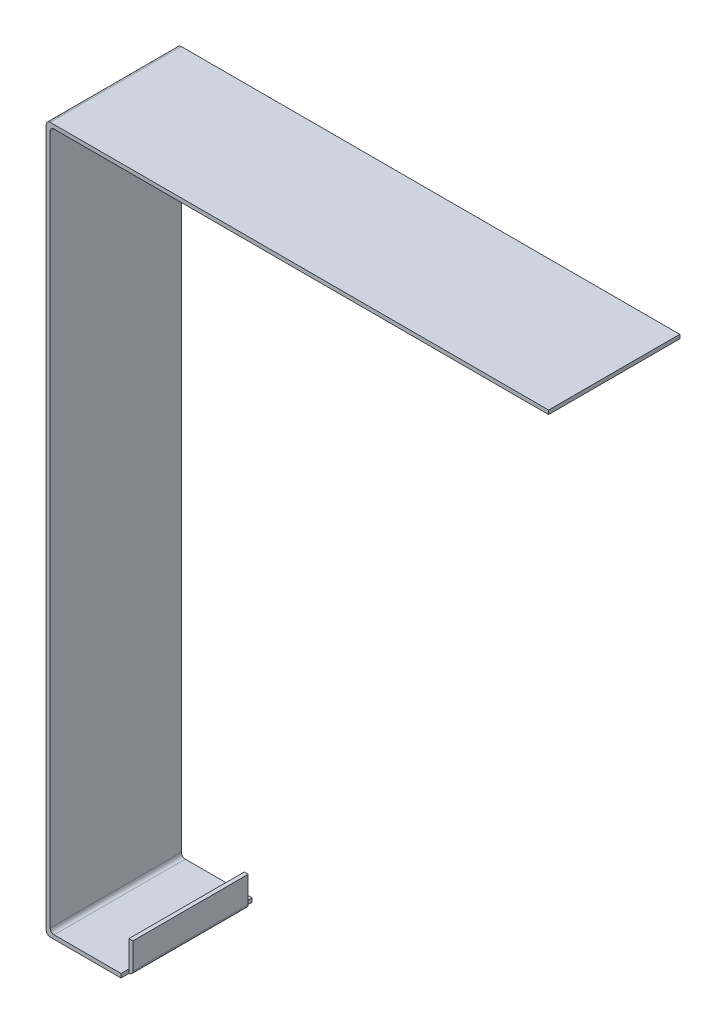
ISO-10303-21;
HEADER;
FILE_DESCRIPTION(('STEP AP214'),'2;1');
FILE_NAME('part.step','',(''),(''),'','','');
FILE_SCHEMA(('AUTOMOTIVE_DESIGN { 1 0 10303 214 1 1 1 1 }'));
ENDSEC;
DATA;
#1=APPLICATION_CONTEXT('core data for automotive mechanical design processes');
#2=APPLICATION_PROTOCOL_DEFINITION('international standard','automotive_design',2000,#1);
#3=PRODUCT_CONTEXT('',#1,'mechanical');
#4=PRODUCT('Part','Part','',(#3));
#5=PRODUCT_RELATED_PRODUCT_CATEGORY('part','',(#4));
#6=PRODUCT_DEFINITION_FORMATION('','',#4);
#7=PRODUCT_DEFINITION_CONTEXT('part definition',#1,'design');
#8=PRODUCT_DEFINITION('design','',#6,#7);
#9=PRODUCT_DEFINITION_SHAPE('','',#8);
#10=(LENGTH_UNIT() NAMED_UNIT(*) SI_UNIT(.MILLI.,.METRE.));
#11=(NAMED_UNIT(*) PLANE_ANGLE_UNIT() SI_UNIT($,.RADIAN.));
#12=(NAMED_UNIT(*) SI_UNIT($,.STERADIAN.) SOLID_ANGLE_UNIT());
#13=UNCERTAINTY_MEASURE_WITH_UNIT(LENGTH_MEASURE(1.E-05),#10,'distance_accuracy_value','');
#14=(GEOMETRIC_REPRESENTATION_CONTEXT(3) GLOBAL_UNCERTAINTY_ASSIGNED_CONTEXT((#13)) GLOBAL_UNIT_ASSIGNED_CONTEXT((#10,
#11,#12)) REPRESENTATION_CONTEXT('',''));
#15=CARTESIAN_POINT('',(0.,0.,0.));
#16=DIRECTION('',(0.,0.,1.));
#17=DIRECTION('',(1.,0.,0.));
#18=AXIS2_PLACEMENT_3D('',#15,#16,#17);
#19=CARTESIAN_POINT('',(-15.082688736803,-236.138930447239,50.));
#20=DIRECTION('',(0.,0.,-1.));
#21=DIRECTION('',(-1.,0.,0.));
#22=AXIS2_PLACEMENT_3D('',#19,#20,#21);
#23=CYLINDRICAL_SURFACE('',#22,1.5);
#24=DIRECTION('',(0.,0.,-1.));
#25=VECTOR('',#24,1.);
#26=CARTESIAN_POINT('',(-13.582688736803,-236.138930447239,50.));
#27=LINE('',#26,#25);
#28=CARTESIAN_POINT('',(-13.582688736803,-236.138930447239,47.));
#29=VERTEX_POINT('',#28);
#30=CARTESIAN_POINT('',(-13.582688736803,-236.138930447239,3.));
#31=VERTEX_POINT('',#30);
#32=EDGE_CURVE('E160',#29,#31,#27,.T.);
#33=ORIENTED_EDGE('',*,*,#32,.F.);
#34=CARTESIAN_POINT('',(-15.082688736803,-236.138930447239,47.));
#35=DIRECTION('',(0.,0.,-1.));
#36=DIRECTION('',(-1.,0.,0.));
#37=AXIS2_PLACEMENT_3D('',#34,#35,#36);
#38=CIRCLE('',#37,1.5);
#39=CARTESIAN_POINT('',(-15.082688736803,-237.638930447239,47.));
#40=VERTEX_POINT('',#39);
#41=EDGE_CURVE('E42',#40,#29,#38,.F.);
#42=ORIENTED_EDGE('',*,*,#41,.F.);
#43=DIRECTION('',(0.,0.,-1.));
#44=VECTOR('',#43,1.);
#45=CARTESIAN_POINT('',(-15.082688736803,-237.638930447239,50.));
#46=LINE('',#45,#44);
#47=CARTESIAN_POINT('',(-15.082688736803,-237.638930447239,3.));
#48=VERTEX_POINT('',#47);
#49=EDGE_CURVE('E170',#48,#40,#46,.F.);
#50=ORIENTED_EDGE('',*,*,#49,.F.);
#51=CARTESIAN_POINT('',(-15.082688736803,-236.138930447239,3.));
#52=DIRECTION('',(0.,0.,1.));
#53=DIRECTION('',(1.,0.,0.));
#54=AXIS2_PLACEMENT_3D('',#51,#52,#53);
#55=CIRCLE('',#54,1.5);
#56=EDGE_CURVE('E11',#31,#48,#55,.F.);
#57=ORIENTED_EDGE('',*,*,#56,.F.);
#58=EDGE_LOOP('',(#33,#42,#50,#57));
#59=FACE_BOUND('',#58,.T.);
#60=ADVANCED_FACE('F35',(#59),#23,.T.);
#61=CARTESIAN_POINT('',(-42.082688736803,29.8610695527614,50.));
#62=DIRECTION('',(0.,0.,-1.));
#63=DIRECTION('',(-1.,0.,0.));
#64=AXIS2_PLACEMENT_3D('',#61,#62,#63);
#65=PLANE('',#64);
#66=DIRECTION('',(0.,-1.,0.));
#67=VECTOR('',#66,1.);
#68=CARTESIAN_POINT('',(-15.082688736803,29.8610695527614,50.));
#69=LINE('',#68,#67);
#70=CARTESIAN_POINT('',(-15.082688736803,-236.138930447239,50.));
#71=VERTEX_POINT('',#70);
#72=CARTESIAN_POINT('',(-15.082688736803,-237.638930447239,50.));
#73=VERTEX_POINT('',#72);
#74=EDGE_CURVE('E150',#71,#73,#69,.T.);
#75=ORIENTED_EDGE('',*,*,#74,.F.);
#76=DIRECTION('',(-1.,0.,0.));
#77=VECTOR('',#76,1.);
#78=CARTESIAN_POINT('',(-15.082688736803,-236.138930447239,50.));
#79=LINE('',#78,#77);
#80=CARTESIAN_POINT('',(-40.582688736803,-236.138930447239,50.));
#81=VERTEX_POINT('',#80);
#82=EDGE_CURVE('E178',#71,#81,#79,.T.);
#83=ORIENTED_EDGE('',*,*,#82,.T.);
#84=CARTESIAN_POINT('',(-40.582688736803,-234.638930447239,50.));
#85=DIRECTION('',(0.,0.,-1.));
#86=DIRECTION('',(1.,0.,0.));
#87=AXIS2_PLACEMENT_3D('',#84,#85,#86);
#88=CIRCLE('',#87,1.5);
#89=CARTESIAN_POINT('',(-42.082688736803,-234.638930447239,50.));
#90=VERTEX_POINT('',#89);
#91=EDGE_CURVE('E180',#81,#90,#88,.T.);
#92=ORIENTED_EDGE('',*,*,#91,.T.);
#93=DIRECTION('',(0.,1.,0.));
#94=VECTOR('',#93,1.);
#95=CARTESIAN_POINT('',(-42.082688736803,-226.138930447239,50.));
#96=LINE('',#95,#94);
#97=CARTESIAN_POINT('',(-42.082688736803,28.3610695527614,50.));
#98=VERTEX_POINT('',#97);
#99=EDGE_CURVE('E187',#90,#98,#96,.T.);
#100=ORIENTED_EDGE('',*,*,#99,.T.);
#101=CARTESIAN_POINT('',(-40.582688736803,28.3610695527614,50.));
#102=DIRECTION('',(0.,0.,-1.));
#103=DIRECTION('',(-1.,0.,0.));
#104=AXIS2_PLACEMENT_3D('',#101,#102,#103);
#105=CIRCLE('',#104,1.5);
#106=CARTESIAN_POINT('',(-40.582688736803,29.8610695527614,50.));
#107=VERTEX_POINT('',#106);
#108=EDGE_CURVE('E189',#98,#107,#105,.T.);
#109=ORIENTED_EDGE('',*,*,#108,.T.);
#110=DIRECTION('',(1.,0.,0.));
#111=VECTOR('',#110,1.);
#112=CARTESIAN_POINT('',(-40.582688736803,29.8610695527614,50.));
#113=LINE('',#112,#111);
#114=CARTESIAN_POINT('',(147.917311263197,29.8610695527614,50.));
#115=VERTEX_POINT('',#114);
#116=EDGE_CURVE('E191',#107,#115,#113,.T.);
#117=ORIENTED_EDGE('',*,*,#116,.T.);
#118=DIRECTION('',(0.,1.,0.));
#119=VECTOR('',#118,1.);
#120=CARTESIAN_POINT('',(147.917311263197,29.8610695527614,50.));
#121=LINE('',#120,#119);
#122=CARTESIAN_POINT('',(147.917311263197,31.3610695527614,50.));
#123=VERTEX_POINT('',#122);
#124=EDGE_CURVE('E221',#115,#123,#121,.T.);
#125=ORIENTED_EDGE('',*,*,#124,.T.);
#126=DIRECTION('',(-1.,0.,0.));
#127=VECTOR('',#126,1.);
#128=CARTESIAN_POINT('',(-42.082688736803,31.3610695527614,50.));
#129=LINE('',#128,#127);
#130=CARTESIAN_POINT('',(-42.082688736803,31.3610695527614,50.));
#131=VERTEX_POINT('',#130);
#132=EDGE_CURVE('E285',#123,#131,#129,.T.);
#133=ORIENTED_EDGE('',*,*,#132,.T.);
#134=CARTESIAN_POINT('',(-42.082688736803,29.8610695527614,50.));
#135=DIRECTION('',(0.,0.,1.));
#136=DIRECTION('',(-1.,0.,0.));
#137=AXIS2_PLACEMENT_3D('',#134,#135,#136);
#138=CIRCLE('',#137,1.5);
#139=CARTESIAN_POINT('',(-43.582688736803,29.8610695527614,50.));
#140=VERTEX_POINT('',#139);
#141=EDGE_CURVE('E287',#131,#140,#138,.T.);
#142=ORIENTED_EDGE('',*,*,#141,.T.);
#143=DIRECTION('',(0.,-1.,0.));
#144=VECTOR('',#143,1.);
#145=CARTESIAN_POINT('',(-43.582688736803,-236.138930447239,50.));
#146=LINE('',#145,#144);
#147=CARTESIAN_POINT('',(-43.582688736803,-236.138930447239,50.));
#148=VERTEX_POINT('',#147);
#149=EDGE_CURVE('E182',#140,#148,#146,.T.);
#150=ORIENTED_EDGE('',*,*,#149,.T.);
#151=CARTESIAN_POINT('',(-42.082688736803,-236.138930447239,50.));
#152=DIRECTION('',(0.,0.,1.));
#153=DIRECTION('',(1.,0.,0.));
#154=AXIS2_PLACEMENT_3D('',#151,#152,#153);
#155=CIRCLE('',#154,1.5);
#156=CARTESIAN_POINT('',(-42.082688736803,-237.638930447239,50.));
#157=VERTEX_POINT('',#156);
#158=EDGE_CURVE('E176',#148,#157,#155,.T.);
#159=ORIENTED_EDGE('',*,*,#158,.T.);
#160=DIRECTION('',(1.,0.,0.));
#161=VECTOR('',#160,1.);
#162=CARTESIAN_POINT('',(-15.082688736803,-237.638930447239,50.));
#163=LINE('',#162,#161);
#164=EDGE_CURVE('E169',#157,#73,#163,.T.);
#165=ORIENTED_EDGE('',*,*,#164,.T.);
#166=EDGE_LOOP('',(#75,#83,#92,#100,#109,#117,#125,#133,#142,#150,#159,#165));
#167=FACE_BOUND('',#166,.T.);
#168=ADVANCED_FACE('F174',(#167),#65,.F.);
#169=CARTESIAN_POINT('',(147.917311263197,29.8610695527614,50.));
#170=DIRECTION('',(-1.,0.,0.));
#171=DIRECTION('',(0.,0.,1.));
#172=AXIS2_PLACEMENT_3D('',#169,#170,#171);
#173=PLANE('',#172);
#174=DIRECTION('',(0.,1.,0.));
#175=VECTOR('',#174,1.);
#176=CARTESIAN_POINT('',(147.917311263197,29.8610695527614,0.));
#177=LINE('',#176,#175);
#178=CARTESIAN_POINT('',(147.917311263197,29.8610695527614,0.));
#179=VERTEX_POINT('',#178);
#180=CARTESIAN_POINT('',(147.917311263197,31.3610695527614,0.));
#181=VERTEX_POINT('',#180);
#182=EDGE_CURVE('E194',#179,#181,#177,.T.);
#183=ORIENTED_EDGE('',*,*,#182,.T.);
#184=DIRECTION('',(0.,0.,-1.));
#185=VECTOR('',#184,1.);
#186=CARTESIAN_POINT('',(147.917311263197,31.3610695527614,50.));
#187=LINE('',#186,#185);
#188=EDGE_CURVE('E161',#123,#181,#187,.T.);
#189=ORIENTED_EDGE('',*,*,#188,.F.);
#190=ORIENTED_EDGE('',*,*,#124,.F.);
#191=DIRECTION('',(0.,0.,-1.));
#192=VECTOR('',#191,1.);
#193=CARTESIAN_POINT('',(147.917311263197,29.8610695527614,50.));
#194=LINE('',#193,#192);
#195=EDGE_CURVE('E193',#115,#179,#194,.T.);
#196=ORIENTED_EDGE('',*,*,#195,.T.);
#197=EDGE_LOOP('',(#183,#189,#190,#196));
#198=FACE_BOUND('',#197,.T.);
#199=ADVANCED_FACE('F331',(#198),#173,.F.);
#200=CARTESIAN_POINT('',(-42.082688736803,31.3610695527614,50.));
#201=DIRECTION('',(0.,-1.,0.));
#202=DIRECTION('',(1.,0.,0.));
#203=AXIS2_PLACEMENT_3D('',#200,#201,#202);
#204=PLANE('',#203);
#205=DIRECTION('',(-1.,0.,0.));
#206=VECTOR('',#205,1.);
#207=CARTESIAN_POINT('',(-42.082688736803,31.3610695527614,0.));
#208=LINE('',#207,#206);
#209=CARTESIAN_POINT('',(-42.082688736803,31.3610695527614,0.));
#210=VERTEX_POINT('',#209);
#211=EDGE_CURVE('E197',#181,#210,#208,.T.);
#212=ORIENTED_EDGE('',*,*,#211,.T.);
#213=DIRECTION('',(0.,0.,-1.));
#214=VECTOR('',#213,1.);
#215=CARTESIAN_POINT('',(-42.082688736803,31.3610695527614,50.));
#216=LINE('',#215,#214);
#217=EDGE_CURVE('E252',#131,#210,#216,.T.);
#218=ORIENTED_EDGE('',*,*,#217,.F.);
#219=ORIENTED_EDGE('',*,*,#132,.F.);
#220=ORIENTED_EDGE('',*,*,#188,.T.);
#221=EDGE_LOOP('',(#212,#218,#219,#220));
#222=FACE_BOUND('',#221,.T.);
#223=ADVANCED_FACE('F336',(#222),#204,.F.);
#224=CARTESIAN_POINT('',(-42.082688736803,29.8610695527614,50.));
#225=DIRECTION('',(0.,0.,-1.));
#226=DIRECTION('',(-1.,0.,0.));
#227=AXIS2_PLACEMENT_3D('',#224,#225,#226);
#228=CYLINDRICAL_SURFACE('',#227,1.5);
#229=CARTESIAN_POINT('',(-42.082688736803,29.8610695527614,0.));
#230=DIRECTION('',(0.,0.,1.));
#231=DIRECTION('',(-1.,0.,0.));
#232=AXIS2_PLACEMENT_3D('',#229,#230,#231);
#233=CIRCLE('',#232,1.5);
#234=CARTESIAN_POINT('',(-43.582688736803,29.8610695527614,0.));
#235=VERTEX_POINT('',#234);
#236=EDGE_CURVE('E200',#210,#235,#233,.T.);
#237=ORIENTED_EDGE('',*,*,#236,.T.);
#238=DIRECTION('',(0.,0.,-1.));
#239=VECTOR('',#238,1.);
#240=CARTESIAN_POINT('',(-43.582688736803,29.8610695527614,50.));
#241=LINE('',#240,#239);
#242=EDGE_CURVE('E249',#140,#235,#241,.T.);
#243=ORIENTED_EDGE('',*,*,#242,.F.);
#244=ORIENTED_EDGE('',*,*,#141,.F.);
#245=ORIENTED_EDGE('',*,*,#217,.T.);
#246=EDGE_LOOP('',(#237,#243,#244,#245));
#247=FACE_BOUND('',#246,.T.);
#248=ADVANCED_FACE('F375',(#247),#228,.T.);
#249=CARTESIAN_POINT('',(-43.582688736803,-236.138930447239,50.));
#250=DIRECTION('',(1.,0.,0.));
#251=DIRECTION('',(0.,0.,-1.));
#252=AXIS2_PLACEMENT_3D('',#249,#250,#251);
#253=PLANE('',#252);
#254=DIRECTION('',(0.,-1.,0.));
#255=VECTOR('',#254,1.);
#256=CARTESIAN_POINT('',(-43.582688736803,-236.138930447239,0.));
#257=LINE('',#256,#255);
#258=CARTESIAN_POINT('',(-43.582688736803,-236.138930447239,0.));
#259=VERTEX_POINT('',#258);
#260=EDGE_CURVE('E202',#235,#259,#257,.T.);
#261=ORIENTED_EDGE('',*,*,#260,.T.);
#262=DIRECTION('',(0.,0.,-1.));
#263=VECTOR('',#262,1.);
#264=CARTESIAN_POINT('',(-43.582688736803,-236.138930447239,50.));
#265=LINE('',#264,#263);
#266=EDGE_CURVE('E246',#148,#259,#265,.T.);
#267=ORIENTED_EDGE('',*,*,#266,.F.);
#268=ORIENTED_EDGE('',*,*,#149,.F.);
#269=ORIENTED_EDGE('',*,*,#242,.T.);
#270=EDGE_LOOP('',(#261,#267,#268,#269));
#271=FACE_BOUND('',#270,.T.);
#272=ADVANCED_FACE('F293',(#271),#253,.F.);
#273=CARTESIAN_POINT('',(-42.082688736803,-236.138930447239,50.));
#274=DIRECTION('',(0.,0.,-1.));
#275=DIRECTION('',(-1.,0.,0.));
#276=AXIS2_PLACEMENT_3D('',#273,#274,#275);
#277=CYLINDRICAL_SURFACE('',#276,1.5);
#278=CARTESIAN_POINT('',(-42.082688736803,-236.138930447239,0.));
#279=DIRECTION('',(0.,0.,1.));
#280=DIRECTION('',(1.,0.,0.));
#281=AXIS2_PLACEMENT_3D('',#278,#279,#280);
#282=CIRCLE('',#281,1.5);
#283=CARTESIAN_POINT('',(-42.082688736803,-237.638930447239,0.));
#284=VERTEX_POINT('',#283);
#285=EDGE_CURVE('E204',#259,#284,#282,.T.);
#286=ORIENTED_EDGE('',*,*,#285,.T.);
#287=DIRECTION('',(0.,0.,-1.));
#288=VECTOR('',#287,1.);
#289=CARTESIAN_POINT('',(-42.082688736803,-237.638930447239,50.));
#290=LINE('',#289,#288);
#291=EDGE_CURVE('E244',#157,#284,#290,.T.);
#292=ORIENTED_EDGE('',*,*,#291,.F.);
#293=ORIENTED_EDGE('',*,*,#158,.F.);
#294=ORIENTED_EDGE('',*,*,#266,.T.);
#295=EDGE_LOOP('',(#286,#292,#293,#294));
#296=FACE_BOUND('',#295,.T.);
#297=ADVANCED_FACE('F297',(#296),#277,.T.);
#298=CARTESIAN_POINT('',(-13.582688736803,-237.638930447239,50.));
#299=DIRECTION('',(0.,1.,0.));
#300=DIRECTION('',(0.,0.,1.));
#301=AXIS2_PLACEMENT_3D('',#298,#299,#300);
#302=PLANE('',#301);
#303=DIRECTION('',(0.,0.,-1.));
#304=VECTOR('',#303,1.);
#305=CARTESIAN_POINT('',(-15.082688736803,-237.638930447239,0.));
#306=LINE('',#305,#304);
#307=CARTESIAN_POINT('',(-15.082688736803,-237.638930447239,0.));
#308=VERTEX_POINT('',#307);
#309=EDGE_CURVE('E298',#48,#308,#306,.T.);
#310=ORIENTED_EDGE('',*,*,#309,.F.);
#311=ORIENTED_EDGE('',*,*,#49,.T.);
#312=DIRECTION('',(0.,0.,-1.));
#313=VECTOR('',#312,1.);
#314=CARTESIAN_POINT('',(-15.082688736803,-237.638930447239,50.));
#315=LINE('',#314,#313);
#316=EDGE_CURVE('E154',#73,#40,#315,.T.);
#317=ORIENTED_EDGE('',*,*,#316,.F.);
#318=ORIENTED_EDGE('',*,*,#164,.F.);
#319=ORIENTED_EDGE('',*,*,#291,.T.);
#320=DIRECTION('',(1.,0.,0.));
#321=VECTOR('',#320,1.);
#322=CARTESIAN_POINT('',(-13.582688736803,-237.638930447239,0.));
#323=LINE('',#322,#321);
#324=EDGE_CURVE('E207',#284,#308,#323,.T.);
#325=ORIENTED_EDGE('',*,*,#324,.T.);
#326=EDGE_LOOP('',(#310,#311,#317,#318,#319,#325));
#327=FACE_BOUND('',#326,.T.);
#328=ADVANCED_FACE('F167',(#327),#302,.F.);
#329=CARTESIAN_POINT('',(-13.582688736803,-226.138930447239,50.));
#330=DIRECTION('',(-1.,0.,0.));
#331=DIRECTION('',(0.,0.,1.));
#332=AXIS2_PLACEMENT_3D('',#329,#330,#331);
#333=PLANE('',#332);
#334=DIRECTION('',(0.,1.,0.));
#335=VECTOR('',#334,1.);
#336=CARTESIAN_POINT('',(-13.582688736803,-237.638930447239,47.));
#337=LINE('',#336,#335);
#338=CARTESIAN_POINT('',(-13.582688736803,-226.138930447239,47.));
#339=VERTEX_POINT('',#338);
#340=EDGE_CURVE('E172',#29,#339,#337,.T.);
#341=ORIENTED_EDGE('',*,*,#340,.F.);
#342=ORIENTED_EDGE('',*,*,#32,.T.);
#343=DIRECTION('',(0.,-1.,0.));
#344=VECTOR('',#343,1.);
#345=CARTESIAN_POINT('',(-13.582688736803,-237.638930447239,3.));
#346=LINE('',#345,#344);
#347=CARTESIAN_POINT('',(-13.582688736803,-226.138930447239,3.));
#348=VERTEX_POINT('',#347);
#349=EDGE_CURVE('E264',#348,#31,#346,.T.);
#350=ORIENTED_EDGE('',*,*,#349,.F.);
#351=DIRECTION('',(0.,0.,-1.));
#352=VECTOR('',#351,1.);
#353=CARTESIAN_POINT('',(-13.582688736803,-226.138930447239,50.));
#354=LINE('',#353,#352);
#355=EDGE_CURVE('E241',#339,#348,#354,.T.);
#356=ORIENTED_EDGE('',*,*,#355,.F.);
#357=EDGE_LOOP('',(#341,#342,#350,#356));
#358=FACE_BOUND('',#357,.T.);
#359=ADVANCED_FACE('F262',(#358),#333,.F.);
#360=CARTESIAN_POINT('',(-15.082688736803,-226.138930447239,50.));
#361=DIRECTION('',(0.,-1.,0.));
#362=DIRECTION('',(0.,0.,-1.));
#363=AXIS2_PLACEMENT_3D('',#360,#361,#362);
#364=PLANE('',#363);
#365=DIRECTION('',(0.,0.,-1.));
#366=VECTOR('',#365,1.);
#367=CARTESIAN_POINT('',(-15.082688736803,-226.138930447239,50.));
#368=LINE('',#367,#366);
#369=CARTESIAN_POINT('',(-15.082688736803,-226.138930447239,47.));
#370=VERTEX_POINT('',#369);
#371=CARTESIAN_POINT('',(-15.082688736803,-226.138930447239,3.));
#372=VERTEX_POINT('',#371);
#373=EDGE_CURVE('E238',#370,#372,#368,.T.);
#374=ORIENTED_EDGE('',*,*,#373,.F.);
#375=DIRECTION('',(1.,0.,0.));
#376=VECTOR('',#375,1.);
#377=CARTESIAN_POINT('',(-15.082688736803,-226.138930447239,47.));
#378=LINE('',#377,#376);
#379=EDGE_CURVE('E282',#370,#339,#378,.T.);
#380=ORIENTED_EDGE('',*,*,#379,.T.);
#381=ORIENTED_EDGE('',*,*,#355,.T.);
#382=DIRECTION('',(1.,0.,0.));
#383=VECTOR('',#382,1.);
#384=CARTESIAN_POINT('',(-15.082688736803,-226.138930447239,3.));
#385=LINE('',#384,#383);
#386=EDGE_CURVE('E269',#372,#348,#385,.T.);
#387=ORIENTED_EDGE('',*,*,#386,.F.);
#388=EDGE_LOOP('',(#374,#380,#381,#387));
#389=FACE_BOUND('',#388,.T.);
#390=ADVANCED_FACE('F318',(#389),#364,.F.);
#391=CARTESIAN_POINT('',(-15.082688736803,-234.638930447239,50.));
#392=DIRECTION('',(1.,0.,0.));
#393=DIRECTION('',(0.,0.,-1.));
#394=AXIS2_PLACEMENT_3D('',#391,#392,#393);
#395=PLANE('',#394);
#396=DIRECTION('',(0.,0.,-1.));
#397=VECTOR('',#396,1.);
#398=CARTESIAN_POINT('',(-15.082688736803,-236.138930447239,50.));
#399=LINE('',#398,#397);
#400=CARTESIAN_POINT('',(-15.082688736803,-236.138930447239,47.));
#401=VERTEX_POINT('',#400);
#402=CARTESIAN_POINT('',(-15.082688736803,-236.138930447239,3.));
#403=VERTEX_POINT('',#402);
#404=EDGE_CURVE('E236',#401,#403,#399,.T.);
#405=ORIENTED_EDGE('',*,*,#404,.F.);
#406=DIRECTION('',(0.,1.,0.));
#407=VECTOR('',#406,1.);
#408=CARTESIAN_POINT('',(-15.082688736803,-237.638930447239,47.));
#409=LINE('',#408,#407);
#410=EDGE_CURVE('E171',#401,#370,#409,.T.);
#411=ORIENTED_EDGE('',*,*,#410,.T.);
#412=ORIENTED_EDGE('',*,*,#373,.T.);
#413=DIRECTION('',(0.,-1.,0.));
#414=VECTOR('',#413,1.);
#415=CARTESIAN_POINT('',(-15.082688736803,-237.638930447239,3.));
#416=LINE('',#415,#414);
#417=EDGE_CURVE('E273',#372,#403,#416,.T.);
#418=ORIENTED_EDGE('',*,*,#417,.T.);
#419=EDGE_LOOP('',(#405,#411,#412,#418));
#420=FACE_BOUND('',#419,.T.);
#421=ADVANCED_FACE('F315',(#420),#395,.F.);
#422=CARTESIAN_POINT('',(-40.582688736803,-236.138930447239,50.));
#423=DIRECTION('',(0.,-1.,0.));
#424=DIRECTION('',(0.,0.,-1.));
#425=AXIS2_PLACEMENT_3D('',#422,#423,#424);
#426=PLANE('',#425);
#427=DIRECTION('',(-1.,0.,0.));
#428=VECTOR('',#427,1.);
#429=CARTESIAN_POINT('',(-40.582688736803,-236.138930447239,0.));
#430=LINE('',#429,#428);
#431=CARTESIAN_POINT('',(-15.082688736803,-236.138930447239,0.));
#432=VERTEX_POINT('',#431);
#433=CARTESIAN_POINT('',(-40.582688736803,-236.138930447239,0.));
#434=VERTEX_POINT('',#433);
#435=EDGE_CURVE('E210',#432,#434,#430,.T.);
#436=ORIENTED_EDGE('',*,*,#435,.T.);
#437=DIRECTION('',(0.,0.,-1.));
#438=VECTOR('',#437,1.);
#439=CARTESIAN_POINT('',(-40.582688736803,-236.138930447239,50.));
#440=LINE('',#439,#438);
#441=EDGE_CURVE('E233',#81,#434,#440,.T.);
#442=ORIENTED_EDGE('',*,*,#441,.F.);
#443=ORIENTED_EDGE('',*,*,#82,.F.);
#444=EDGE_CURVE('E156',#71,#401,#399,.T.);
#445=ORIENTED_EDGE('',*,*,#444,.T.);
#446=ORIENTED_EDGE('',*,*,#404,.T.);
#447=DIRECTION('',(0.,0.,-1.));
#448=VECTOR('',#447,1.);
#449=CARTESIAN_POINT('',(-15.082688736803,-236.138930447239,50.));
#450=LINE('',#449,#448);
#451=EDGE_CURVE('E198',#403,#432,#450,.T.);
#452=ORIENTED_EDGE('',*,*,#451,.T.);
#453=EDGE_LOOP('',(#436,#442,#443,#445,#446,#452));
#454=FACE_BOUND('',#453,.T.);
#455=ADVANCED_FACE('F358',(#454),#426,.F.);
#456=CARTESIAN_POINT('',(-40.582688736803,-234.638930447239,50.));
#457=DIRECTION('',(0.,0.,-1.));
#458=DIRECTION('',(-1.,0.,0.));
#459=AXIS2_PLACEMENT_3D('',#456,#457,#458);
#460=CYLINDRICAL_SURFACE('',#459,1.5);
#461=CARTESIAN_POINT('',(-40.582688736803,-234.638930447239,0.));
#462=DIRECTION('',(0.,0.,-1.));
#463=DIRECTION('',(1.,0.,0.));
#464=AXIS2_PLACEMENT_3D('',#461,#462,#463);
#465=CIRCLE('',#464,1.5);
#466=CARTESIAN_POINT('',(-42.082688736803,-234.638930447239,0.));
#467=VERTEX_POINT('',#466);
#468=EDGE_CURVE('E212',#434,#467,#465,.T.);
#469=ORIENTED_EDGE('',*,*,#468,.T.);
#470=DIRECTION('',(0.,0.,-1.));
#471=VECTOR('',#470,1.);
#472=CARTESIAN_POINT('',(-42.082688736803,-234.638930447239,50.));
#473=LINE('',#472,#471);
#474=EDGE_CURVE('E230',#90,#467,#473,.T.);
#475=ORIENTED_EDGE('',*,*,#474,.F.);
#476=ORIENTED_EDGE('',*,*,#91,.F.);
#477=ORIENTED_EDGE('',*,*,#441,.T.);
#478=EDGE_LOOP('',(#469,#475,#476,#477));
#479=FACE_BOUND('',#478,.T.);
#480=ADVANCED_FACE('F354',(#479),#460,.F.);
#481=CARTESIAN_POINT('',(-42.082688736803,28.3610695527614,50.));
#482=DIRECTION('',(-1.,0.,0.));
#483=DIRECTION('',(0.,0.,1.));
#484=AXIS2_PLACEMENT_3D('',#481,#482,#483);
#485=PLANE('',#484);
#486=DIRECTION('',(0.,1.,0.));
#487=VECTOR('',#486,1.);
#488=CARTESIAN_POINT('',(-42.082688736803,28.3610695527614,0.));
#489=LINE('',#488,#487);
#490=CARTESIAN_POINT('',(-42.082688736803,28.3610695527614,0.));
#491=VERTEX_POINT('',#490);
#492=EDGE_CURVE('E215',#467,#491,#489,.T.);
#493=ORIENTED_EDGE('',*,*,#492,.T.);
#494=DIRECTION('',(0.,0.,-1.));
#495=VECTOR('',#494,1.);
#496=CARTESIAN_POINT('',(-42.082688736803,28.3610695527614,50.));
#497=LINE('',#496,#495);
#498=EDGE_CURVE('E227',#98,#491,#497,.T.);
#499=ORIENTED_EDGE('',*,*,#498,.F.);
#500=ORIENTED_EDGE('',*,*,#99,.F.);
#501=ORIENTED_EDGE('',*,*,#474,.T.);
#502=EDGE_LOOP('',(#493,#499,#500,#501));
#503=FACE_BOUND('',#502,.T.);
#504=ADVANCED_FACE('F350',(#503),#485,.F.);
#505=CARTESIAN_POINT('',(-40.582688736803,28.3610695527614,50.));
#506=DIRECTION('',(0.,0.,-1.));
#507=DIRECTION('',(-1.,0.,0.));
#508=AXIS2_PLACEMENT_3D('',#505,#506,#507);
#509=CYLINDRICAL_SURFACE('',#508,1.5);
#510=CARTESIAN_POINT('',(-40.582688736803,28.3610695527614,0.));
#511=DIRECTION('',(0.,0.,-1.));
#512=DIRECTION('',(-1.,0.,0.));
#513=AXIS2_PLACEMENT_3D('',#510,#511,#512);
#514=CIRCLE('',#513,1.5);
#515=CARTESIAN_POINT('',(-40.582688736803,29.8610695527614,0.));
#516=VERTEX_POINT('',#515);
#517=EDGE_CURVE('E217',#491,#516,#514,.T.);
#518=ORIENTED_EDGE('',*,*,#517,.T.);
#519=DIRECTION('',(0.,0.,-1.));
#520=VECTOR('',#519,1.);
#521=CARTESIAN_POINT('',(-40.582688736803,29.8610695527614,50.));
#522=LINE('',#521,#520);
#523=EDGE_CURVE('E224',#107,#516,#522,.T.);
#524=ORIENTED_EDGE('',*,*,#523,.F.);
#525=ORIENTED_EDGE('',*,*,#108,.F.);
#526=ORIENTED_EDGE('',*,*,#498,.T.);
#527=EDGE_LOOP('',(#518,#524,#525,#526));
#528=FACE_BOUND('',#527,.T.);
#529=ADVANCED_FACE('F346',(#528),#509,.F.);
#530=CARTESIAN_POINT('',(-40.582688736803,29.8610695527614,50.));
#531=DIRECTION('',(0.,1.,0.));
#532=DIRECTION('',(0.,0.,1.));
#533=AXIS2_PLACEMENT_3D('',#530,#531,#532);
#534=PLANE('',#533);
#535=DIRECTION('',(1.,0.,0.));
#536=VECTOR('',#535,1.);
#537=CARTESIAN_POINT('',(-40.582688736803,29.8610695527614,0.));
#538=LINE('',#537,#536);
#539=EDGE_CURVE('E219',#516,#179,#538,.T.);
#540=ORIENTED_EDGE('',*,*,#539,.T.);
#541=ORIENTED_EDGE('',*,*,#195,.F.);
#542=ORIENTED_EDGE('',*,*,#116,.F.);
#543=ORIENTED_EDGE('',*,*,#523,.T.);
#544=EDGE_LOOP('',(#540,#541,#542,#543));
#545=FACE_BOUND('',#544,.T.);
#546=ADVANCED_FACE('F343',(#545),#534,.F.);
#547=CARTESIAN_POINT('',(-42.082688736803,29.8610695527614,0.));
#548=DIRECTION('',(0.,0.,-1.));
#549=DIRECTION('',(-1.,0.,0.));
#550=AXIS2_PLACEMENT_3D('',#547,#548,#549);
#551=PLANE('',#550);
#552=DIRECTION('',(0.,1.,0.));
#553=VECTOR('',#552,1.);
#554=CARTESIAN_POINT('',(-15.082688736803,-226.138930447239,0.));
#555=LINE('',#554,#553);
#556=EDGE_CURVE('E277',#308,#432,#555,.T.);
#557=ORIENTED_EDGE('',*,*,#556,.F.);
#558=ORIENTED_EDGE('',*,*,#324,.F.);
#559=ORIENTED_EDGE('',*,*,#285,.F.);
#560=ORIENTED_EDGE('',*,*,#260,.F.);
#561=ORIENTED_EDGE('',*,*,#236,.F.);
#562=ORIENTED_EDGE('',*,*,#211,.F.);
#563=ORIENTED_EDGE('',*,*,#182,.F.);
#564=ORIENTED_EDGE('',*,*,#539,.F.);
#565=ORIENTED_EDGE('',*,*,#517,.F.);
#566=ORIENTED_EDGE('',*,*,#492,.F.);
#567=ORIENTED_EDGE('',*,*,#468,.F.);
#568=ORIENTED_EDGE('',*,*,#435,.F.);
#569=EDGE_LOOP('',(#557,#558,#559,#560,#561,#562,#563,#564,#565,#566,#567,#568));
#570=FACE_BOUND('',#569,.T.);
#571=ADVANCED_FACE('F301',(#570),#551,.T.);
#572=CARTESIAN_POINT('',(-15.082688736803,0.,0.));
#573=DIRECTION('',(-1.,0.,0.));
#574=DIRECTION('',(0.,0.,1.));
#575=AXIS2_PLACEMENT_3D('',#572,#573,#574);
#576=PLANE('',#575);
#577=EDGE_CURVE('E270',#403,#48,#416,.T.);
#578=ORIENTED_EDGE('',*,*,#577,.T.);
#579=ORIENTED_EDGE('',*,*,#309,.T.);
#580=ORIENTED_EDGE('',*,*,#556,.T.);
#581=ORIENTED_EDGE('',*,*,#451,.F.);
#582=EDGE_LOOP('',(#578,#579,#580,#581));
#583=FACE_BOUND('',#582,.T.);
#584=ADVANCED_FACE('F342',(#583),#576,.F.);
#585=CARTESIAN_POINT('',(-15.082688736803,-237.638930447239,3.));
#586=DIRECTION('',(0.,0.,1.));
#587=DIRECTION('',(1.,0.,0.));
#588=AXIS2_PLACEMENT_3D('',#585,#586,#587);
#589=PLANE('',#588);
#590=ORIENTED_EDGE('',*,*,#349,.T.);
#591=ORIENTED_EDGE('',*,*,#56,.T.);
#592=ORIENTED_EDGE('',*,*,#577,.F.);
#593=ORIENTED_EDGE('',*,*,#417,.F.);
#594=ORIENTED_EDGE('',*,*,#386,.T.);
#595=EDGE_LOOP('',(#590,#591,#592,#593,#594));
#596=FACE_BOUND('',#595,.T.);
#597=ADVANCED_FACE('F266',(#596),#589,.F.);
#598=CARTESIAN_POINT('',(-15.082688736803,0.,0.));
#599=DIRECTION('',(1.,0.,0.));
#600=DIRECTION('',(0.,0.,-1.));
#601=AXIS2_PLACEMENT_3D('',#598,#599,#600);
#602=PLANE('',#601);
#603=ORIENTED_EDGE('',*,*,#444,.F.);
#604=ORIENTED_EDGE('',*,*,#74,.T.);
#605=ORIENTED_EDGE('',*,*,#316,.T.);
#606=EDGE_CURVE('E309',#40,#401,#409,.T.);
#607=ORIENTED_EDGE('',*,*,#606,.T.);
#608=EDGE_LOOP('',(#603,#604,#605,#607));
#609=FACE_BOUND('',#608,.T.);
#610=ADVANCED_FACE('F152',(#609),#602,.T.);
#611=CARTESIAN_POINT('',(-15.082688736803,-237.638930447239,47.));
#612=DIRECTION('',(0.,0.,-1.));
#613=DIRECTION('',(-1.,0.,0.));
#614=AXIS2_PLACEMENT_3D('',#611,#612,#613);
#615=PLANE('',#614);
#616=ORIENTED_EDGE('',*,*,#606,.F.);
#617=ORIENTED_EDGE('',*,*,#41,.T.);
#618=ORIENTED_EDGE('',*,*,#340,.T.);
#619=ORIENTED_EDGE('',*,*,#379,.F.);
#620=ORIENTED_EDGE('',*,*,#410,.F.);
#621=EDGE_LOOP('',(#616,#617,#618,#619,#620));
#622=FACE_BOUND('',#621,.T.);
#623=ADVANCED_FACE('F319',(#622),#615,.F.);
#624=CLOSED_SHELL('',(#60,#168,#199,#223,#248,#272,#297,#328,#359,#390,#421,#455,#480,#504,#529,
#546,#571,#584,#597,#610,#623));
#625=MANIFOLD_SOLID_BREP('B2',#624);
#626=ADVANCED_BREP_SHAPE_REPRESENTATION('',(#18,#625),#14);
#627=SHAPE_DEFINITION_REPRESENTATION(#9,#626);
ENDSEC;
END-ISO-10303-21;
